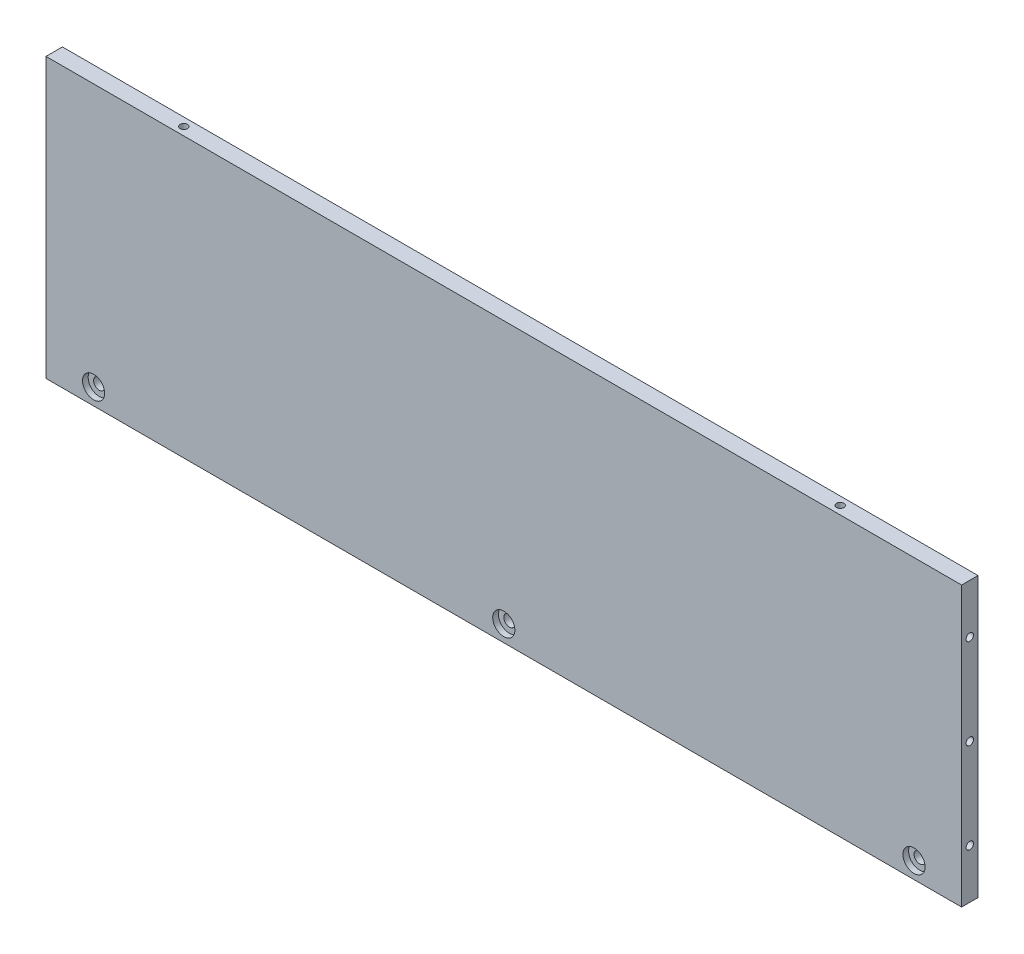
ISO-10303-21;
HEADER;
FILE_DESCRIPTION(('STEP AP214'),'2;1');
FILE_NAME('part.step','',(''),(''),'','','');
FILE_SCHEMA(('AUTOMOTIVE_DESIGN { 1 0 10303 214 1 1 1 1 }'));
ENDSEC;
DATA;
#1=APPLICATION_CONTEXT('core data for automotive mechanical design processes');
#2=APPLICATION_PROTOCOL_DEFINITION('international standard','automotive_design',2000,#1);
#3=PRODUCT_CONTEXT('',#1,'mechanical');
#4=PRODUCT('Part','Part','',(#3));
#5=PRODUCT_RELATED_PRODUCT_CATEGORY('part','',(#4));
#6=PRODUCT_DEFINITION_FORMATION('','',#4);
#7=PRODUCT_DEFINITION_CONTEXT('part definition',#1,'design');
#8=PRODUCT_DEFINITION('design','',#6,#7);
#9=PRODUCT_DEFINITION_SHAPE('','',#8);
#10=(LENGTH_UNIT() NAMED_UNIT(*) SI_UNIT(.MILLI.,.METRE.));
#11=(NAMED_UNIT(*) PLANE_ANGLE_UNIT() SI_UNIT($,.RADIAN.));
#12=(NAMED_UNIT(*) SI_UNIT($,.STERADIAN.) SOLID_ANGLE_UNIT());
#13=UNCERTAINTY_MEASURE_WITH_UNIT(LENGTH_MEASURE(1.E-05),#10,'distance_accuracy_value','');
#14=(GEOMETRIC_REPRESENTATION_CONTEXT(3) GLOBAL_UNCERTAINTY_ASSIGNED_CONTEXT((#13)) GLOBAL_UNIT_ASSIGNED_CONTEXT((#10,
#11,#12)) REPRESENTATION_CONTEXT('',''));
#15=CARTESIAN_POINT('',(0.,0.,0.));
#16=DIRECTION('',(0.,0.,1.));
#17=DIRECTION('',(1.,0.,0.));
#18=AXIS2_PLACEMENT_3D('',#15,#16,#17);
#19=CARTESIAN_POINT('',(-130.996216897856,78.0327868852459,5.));
#20=DIRECTION('',(1.,0.,0.));
#21=DIRECTION('',(0.,1.,0.));
#22=AXIS2_PLACEMENT_3D('',#19,#20,#21);
#23=PLANE('',#22);
#24=CARTESIAN_POINT('',(-130.996216897856,63.0327868852459,2.5));
#25=DIRECTION('',(-1.,0.,0.));
#26=DIRECTION('',(0.,0.,1.));
#27=AXIS2_PLACEMENT_3D('',#24,#25,#26);
#28=CIRCLE('',#27,1.13029999999999);
#29=CARTESIAN_POINT('',(-130.996216897856,63.0327868852459,3.63029999999999));
#30=VERTEX_POINT('',#29);
#31=EDGE_CURVE('E167',#30,#30,#28,.T.);
#32=ORIENTED_EDGE('',*,*,#31,.F.);
#33=EDGE_LOOP('',(#32));
#34=FACE_BOUND('',#33,.T.);
#35=CARTESIAN_POINT('',(-130.996216897856,35.5327868852459,2.5));
#36=DIRECTION('',(-1.,0.,0.));
#37=DIRECTION('',(0.,0.,1.));
#38=AXIS2_PLACEMENT_3D('',#35,#36,#37);
#39=CIRCLE('',#38,1.13029999999999);
#40=CARTESIAN_POINT('',(-130.996216897856,35.5327868852459,3.63029999999999));
#41=VERTEX_POINT('',#40);
#42=EDGE_CURVE('E175',#41,#41,#39,.T.);
#43=ORIENTED_EDGE('',*,*,#42,.F.);
#44=EDGE_LOOP('',(#43));
#45=FACE_BOUND('',#44,.T.);
#46=CARTESIAN_POINT('',(-130.996216897856,8.03278688524591,2.5));
#47=DIRECTION('',(-1.,0.,0.));
#48=DIRECTION('',(0.,0.,1.));
#49=AXIS2_PLACEMENT_3D('',#46,#47,#48);
#50=CIRCLE('',#49,1.13029999999999);
#51=CARTESIAN_POINT('',(-130.996216897856,8.03278688524591,3.63029999999999));
#52=VERTEX_POINT('',#51);
#53=EDGE_CURVE('E183',#52,#52,#50,.T.);
#54=ORIENTED_EDGE('',*,*,#53,.F.);
#55=EDGE_LOOP('',(#54));
#56=FACE_BOUND('',#55,.T.);
#57=DIRECTION('',(0.,-1.,0.));
#58=VECTOR('',#57,1.);
#59=CARTESIAN_POINT('',(-130.996216897856,78.0327868852459,0.));
#60=LINE('',#59,#58);
#61=CARTESIAN_POINT('',(-130.996216897856,78.0327868852459,0.));
#62=VERTEX_POINT('',#61);
#63=CARTESIAN_POINT('',(-130.996216897856,-6.9672131147541,0.));
#64=VERTEX_POINT('',#63);
#65=EDGE_CURVE('E239',#62,#64,#60,.T.);
#66=ORIENTED_EDGE('',*,*,#65,.T.);
#67=DIRECTION('',(0.,0.,-1.));
#68=VECTOR('',#67,1.);
#69=CARTESIAN_POINT('',(-130.996216897856,-6.9672131147541,5.));
#70=LINE('',#69,#68);
#71=CARTESIAN_POINT('',(-130.996216897856,-6.9672131147541,5.));
#72=VERTEX_POINT('',#71);
#73=EDGE_CURVE('E11',#72,#64,#70,.T.);
#74=ORIENTED_EDGE('',*,*,#73,.F.);
#75=DIRECTION('',(0.,-1.,0.));
#76=VECTOR('',#75,1.);
#77=CARTESIAN_POINT('',(-130.996216897856,78.0327868852459,5.));
#78=LINE('',#77,#76);
#79=CARTESIAN_POINT('',(-130.996216897856,78.0327868852459,5.));
#80=VERTEX_POINT('',#79);
#81=EDGE_CURVE('E240',#80,#72,#78,.T.);
#82=ORIENTED_EDGE('',*,*,#81,.F.);
#83=DIRECTION('',(0.,0.,-1.));
#84=VECTOR('',#83,1.);
#85=CARTESIAN_POINT('',(-130.996216897856,78.0327868852459,5.));
#86=LINE('',#85,#84);
#87=EDGE_CURVE('E250',#80,#62,#86,.T.);
#88=ORIENTED_EDGE('',*,*,#87,.T.);
#89=EDGE_LOOP('',(#66,#74,#82,#88));
#90=FACE_BOUND('',#89,.T.);
#91=ADVANCED_FACE('F45',(#34,#45,#56,#90),#23,.F.);
#92=CARTESIAN_POINT('',(-130.996216897856,-6.9672131147541,5.));
#93=DIRECTION('',(0.,1.,0.));
#94=DIRECTION('',(0.,0.,1.));
#95=AXIS2_PLACEMENT_3D('',#92,#93,#94);
#96=PLANE('',#95);
#97=DIRECTION('',(1.,0.,0.));
#98=VECTOR('',#97,1.);
#99=CARTESIAN_POINT('',(-130.996216897856,-6.9672131147541,0.));
#100=LINE('',#99,#98);
#101=CARTESIAN_POINT('',(148.003783102144,-6.9672131147541,0.));
#102=VERTEX_POINT('',#101);
#103=EDGE_CURVE('E254',#64,#102,#100,.T.);
#104=ORIENTED_EDGE('',*,*,#103,.T.);
#105=DIRECTION('',(0.,0.,-1.));
#106=VECTOR('',#105,1.);
#107=CARTESIAN_POINT('',(148.003783102144,-6.9672131147541,5.));
#108=LINE('',#107,#106);
#109=CARTESIAN_POINT('',(148.003783102144,-6.9672131147541,5.));
#110=VERTEX_POINT('',#109);
#111=EDGE_CURVE('E54',#110,#102,#108,.T.);
#112=ORIENTED_EDGE('',*,*,#111,.F.);
#113=DIRECTION('',(1.,0.,0.));
#114=VECTOR('',#113,1.);
#115=CARTESIAN_POINT('',(-130.996216897856,-6.9672131147541,5.));
#116=LINE('',#115,#114);
#117=EDGE_CURVE('E93',#72,#110,#116,.T.);
#118=ORIENTED_EDGE('',*,*,#117,.F.);
#119=ORIENTED_EDGE('',*,*,#73,.T.);
#120=EDGE_LOOP('',(#104,#112,#118,#119));
#121=FACE_BOUND('',#120,.T.);
#122=ADVANCED_FACE('F285',(#121),#96,.F.);
#123=CARTESIAN_POINT('',(148.003783102144,78.0327868852459,5.));
#124=DIRECTION('',(-1.,0.,0.));
#125=DIRECTION('',(0.,-1.,0.));
#126=AXIS2_PLACEMENT_3D('',#123,#124,#125);
#127=PLANE('',#126);
#128=CARTESIAN_POINT('',(148.003783102144,63.0327868852458,2.5));
#129=DIRECTION('',(1.,0.,0.));
#130=DIRECTION('',(0.,0.,-1.));
#131=AXIS2_PLACEMENT_3D('',#128,#129,#130);
#132=CIRCLE('',#131,1.13029999999999);
#133=CARTESIAN_POINT('',(148.003783102144,63.0327868852458,1.36970000000001));
#134=VERTEX_POINT('',#133);
#135=EDGE_CURVE('E143',#134,#134,#132,.T.);
#136=ORIENTED_EDGE('',*,*,#135,.F.);
#137=EDGE_LOOP('',(#136));
#138=FACE_BOUND('',#137,.T.);
#139=CARTESIAN_POINT('',(148.003783102144,35.5327868852458,2.5));
#140=DIRECTION('',(1.,0.,0.));
#141=DIRECTION('',(0.,0.,-1.));
#142=AXIS2_PLACEMENT_3D('',#139,#140,#141);
#143=CIRCLE('',#142,1.13029999999999);
#144=CARTESIAN_POINT('',(148.003783102144,35.5327868852458,1.36970000000001));
#145=VERTEX_POINT('',#144);
#146=EDGE_CURVE('E151',#145,#145,#143,.T.);
#147=ORIENTED_EDGE('',*,*,#146,.F.);
#148=EDGE_LOOP('',(#147));
#149=FACE_BOUND('',#148,.T.);
#150=CARTESIAN_POINT('',(148.003783102144,8.03278688524579,2.5));
#151=DIRECTION('',(1.,0.,0.));
#152=DIRECTION('',(0.,0.,-1.));
#153=AXIS2_PLACEMENT_3D('',#150,#151,#152);
#154=CIRCLE('',#153,1.13029999999999);
#155=CARTESIAN_POINT('',(148.003783102144,8.03278688524579,1.36970000000001));
#156=VERTEX_POINT('',#155);
#157=EDGE_CURVE('E159',#156,#156,#154,.T.);
#158=ORIENTED_EDGE('',*,*,#157,.F.);
#159=EDGE_LOOP('',(#158));
#160=FACE_BOUND('',#159,.T.);
#161=DIRECTION('',(0.,1.,0.));
#162=VECTOR('',#161,1.);
#163=CARTESIAN_POINT('',(148.003783102144,78.0327868852459,0.));
#164=LINE('',#163,#162);
#165=CARTESIAN_POINT('',(148.003783102144,78.0327868852459,0.));
#166=VERTEX_POINT('',#165);
#167=EDGE_CURVE('E80',#102,#166,#164,.T.);
#168=ORIENTED_EDGE('',*,*,#167,.T.);
#169=DIRECTION('',(0.,0.,-1.));
#170=VECTOR('',#169,1.);
#171=CARTESIAN_POINT('',(148.003783102144,78.0327868852459,5.));
#172=LINE('',#171,#170);
#173=CARTESIAN_POINT('',(148.003783102144,78.0327868852459,5.));
#174=VERTEX_POINT('',#173);
#175=EDGE_CURVE('E263',#174,#166,#172,.T.);
#176=ORIENTED_EDGE('',*,*,#175,.F.);
#177=DIRECTION('',(0.,1.,0.));
#178=VECTOR('',#177,1.);
#179=CARTESIAN_POINT('',(148.003783102144,78.0327868852459,5.));
#180=LINE('',#179,#178);
#181=EDGE_CURVE('E245',#110,#174,#180,.T.);
#182=ORIENTED_EDGE('',*,*,#181,.F.);
#183=ORIENTED_EDGE('',*,*,#111,.T.);
#184=EDGE_LOOP('',(#168,#176,#182,#183));
#185=FACE_BOUND('',#184,.T.);
#186=ADVANCED_FACE('F267',(#138,#149,#160,#185),#127,.F.);
#187=CARTESIAN_POINT('',(-130.996216897856,78.0327868852459,5.));
#188=DIRECTION('',(0.,-1.,0.));
#189=DIRECTION('',(0.,0.,-1.));
#190=AXIS2_PLACEMENT_3D('',#187,#188,#189);
#191=PLANE('',#190);
#192=CARTESIAN_POINT('',(-91.4962168978563,78.0327868852459,2.5));
#193=DIRECTION('',(0.,1.,0.));
#194=DIRECTION('',(0.,0.,1.));
#195=AXIS2_PLACEMENT_3D('',#192,#193,#194);
#196=CIRCLE('',#195,1.13029999999999);
#197=CARTESIAN_POINT('',(-91.4962168978563,78.0327868852459,3.63029999999999));
#198=VERTEX_POINT('',#197);
#199=EDGE_CURVE('E130',#198,#198,#196,.T.);
#200=ORIENTED_EDGE('',*,*,#199,.F.);
#201=EDGE_LOOP('',(#200));
#202=FACE_BOUND('',#201,.T.);
#203=CARTESIAN_POINT('',(108.503783102144,78.0327868852459,2.5));
#204=DIRECTION('',(0.,1.,0.));
#205=DIRECTION('',(0.,0.,1.));
#206=AXIS2_PLACEMENT_3D('',#203,#204,#205);
#207=CIRCLE('',#206,1.13029999999999);
#208=CARTESIAN_POINT('',(108.503783102144,78.0327868852459,3.63029999999999));
#209=VERTEX_POINT('',#208);
#210=EDGE_CURVE('E129',#209,#209,#207,.T.);
#211=ORIENTED_EDGE('',*,*,#210,.F.);
#212=EDGE_LOOP('',(#211));
#213=FACE_BOUND('',#212,.T.);
#214=DIRECTION('',(-1.,0.,0.));
#215=VECTOR('',#214,1.);
#216=CARTESIAN_POINT('',(-130.996216897856,78.0327868852459,0.));
#217=LINE('',#216,#215);
#218=EDGE_CURVE('E86',#166,#62,#217,.T.);
#219=ORIENTED_EDGE('',*,*,#218,.T.);
#220=ORIENTED_EDGE('',*,*,#87,.F.);
#221=DIRECTION('',(-1.,0.,0.));
#222=VECTOR('',#221,1.);
#223=CARTESIAN_POINT('',(-130.996216897856,78.0327868852459,5.));
#224=LINE('',#223,#222);
#225=EDGE_CURVE('E62',#174,#80,#224,.T.);
#226=ORIENTED_EDGE('',*,*,#225,.F.);
#227=ORIENTED_EDGE('',*,*,#175,.T.);
#228=EDGE_LOOP('',(#219,#220,#226,#227));
#229=FACE_BOUND('',#228,.T.);
#230=ADVANCED_FACE('F274',(#202,#213,#229),#191,.F.);
#231=CARTESIAN_POINT('',(0.,0.,5.));
#232=DIRECTION('',(0.,0.,1.));
#233=DIRECTION('',(1.,0.,0.));
#234=AXIS2_PLACEMENT_3D('',#231,#232,#233);
#235=PLANE('',#234);
#236=CARTESIAN_POINT('',(-116.496216897856,-1.96721311475409,5.));
#237=DIRECTION('',(0.,0.,1.));
#238=DIRECTION('',(1.,0.,0.));
#239=AXIS2_PLACEMENT_3D('',#236,#237,#238);
#240=CIRCLE('',#239,3.37311999999999);
#241=CARTESIAN_POINT('',(-113.123096897856,-1.96721311475409,5.));
#242=VERTEX_POINT('',#241);
#243=EDGE_CURVE('E191',#242,#242,#240,.T.);
#244=ORIENTED_EDGE('',*,*,#243,.F.);
#245=EDGE_LOOP('',(#244));
#246=FACE_BOUND('',#245,.T.);
#247=CARTESIAN_POINT('',(8.50378310214372,-1.96721311475409,5.));
#248=DIRECTION('',(0.,0.,1.));
#249=DIRECTION('',(1.,0.,0.));
#250=AXIS2_PLACEMENT_3D('',#247,#248,#249);
#251=CIRCLE('',#250,3.37311999999999);
#252=CARTESIAN_POINT('',(11.8769031021437,-1.96721311475409,5.));
#253=VERTEX_POINT('',#252);
#254=EDGE_CURVE('E207',#253,#253,#251,.T.);
#255=ORIENTED_EDGE('',*,*,#254,.F.);
#256=EDGE_LOOP('',(#255));
#257=FACE_BOUND('',#256,.T.);
#258=CARTESIAN_POINT('',(133.503783102144,-1.96721311475409,5.));
#259=DIRECTION('',(0.,0.,1.));
#260=DIRECTION('',(1.,0.,0.));
#261=AXIS2_PLACEMENT_3D('',#258,#259,#260);
#262=CIRCLE('',#261,3.37312000000001);
#263=CARTESIAN_POINT('',(136.876903102144,-1.96721311475409,5.));
#264=VERTEX_POINT('',#263);
#265=EDGE_CURVE('E223',#264,#264,#262,.T.);
#266=ORIENTED_EDGE('',*,*,#265,.F.);
#267=EDGE_LOOP('',(#266));
#268=FACE_BOUND('',#267,.T.);
#269=ORIENTED_EDGE('',*,*,#81,.T.);
#270=ORIENTED_EDGE('',*,*,#117,.T.);
#271=ORIENTED_EDGE('',*,*,#181,.T.);
#272=ORIENTED_EDGE('',*,*,#225,.T.);
#273=EDGE_LOOP('',(#269,#270,#271,#272));
#274=FACE_BOUND('',#273,.T.);
#275=ADVANCED_FACE('F276',(#246,#257,#268,#274),#235,.T.);
#276=CARTESIAN_POINT('',(0.,0.,0.));
#277=DIRECTION('',(0.,0.,1.));
#278=DIRECTION('',(1.,0.,0.));
#279=AXIS2_PLACEMENT_3D('',#276,#277,#278);
#280=PLANE('',#279);
#281=CARTESIAN_POINT('',(-116.496216897856,-1.96721311475409,0.));
#282=DIRECTION('',(0.,0.,1.));
#283=DIRECTION('',(1.,0.,0.));
#284=AXIS2_PLACEMENT_3D('',#281,#282,#283);
#285=CIRCLE('',#284,1.7272);
#286=CARTESIAN_POINT('',(-114.769016897856,-1.96721311475409,0.));
#287=VERTEX_POINT('',#286);
#288=EDGE_CURVE('E203',#287,#287,#285,.T.);
#289=ORIENTED_EDGE('',*,*,#288,.T.);
#290=EDGE_LOOP('',(#289));
#291=FACE_BOUND('',#290,.T.);
#292=CARTESIAN_POINT('',(8.50378310214372,-1.96721311475409,0.));
#293=DIRECTION('',(0.,0.,1.));
#294=DIRECTION('',(1.,0.,0.));
#295=AXIS2_PLACEMENT_3D('',#292,#293,#294);
#296=CIRCLE('',#295,1.7272);
#297=CARTESIAN_POINT('',(10.2309831021437,-1.96721311475409,0.));
#298=VERTEX_POINT('',#297);
#299=EDGE_CURVE('E219',#298,#298,#296,.T.);
#300=ORIENTED_EDGE('',*,*,#299,.T.);
#301=EDGE_LOOP('',(#300));
#302=FACE_BOUND('',#301,.T.);
#303=CARTESIAN_POINT('',(133.503783102144,-1.96721311475409,0.));
#304=DIRECTION('',(0.,0.,1.));
#305=DIRECTION('',(1.,0.,0.));
#306=AXIS2_PLACEMENT_3D('',#303,#304,#305);
#307=CIRCLE('',#306,1.72720000000001);
#308=CARTESIAN_POINT('',(135.230983102144,-1.96721311475409,0.));
#309=VERTEX_POINT('',#308);
#310=EDGE_CURVE('E235',#309,#309,#307,.T.);
#311=ORIENTED_EDGE('',*,*,#310,.T.);
#312=EDGE_LOOP('',(#311));
#313=FACE_BOUND('',#312,.T.);
#314=ORIENTED_EDGE('',*,*,#65,.F.);
#315=ORIENTED_EDGE('',*,*,#218,.F.);
#316=ORIENTED_EDGE('',*,*,#167,.F.);
#317=ORIENTED_EDGE('',*,*,#103,.F.);
#318=EDGE_LOOP('',(#314,#315,#316,#317));
#319=FACE_BOUND('',#318,.T.);
#320=ADVANCED_FACE('F270',(#291,#302,#313,#319),#280,.F.);
#321=CARTESIAN_POINT('',(133.503783102144,-1.96721311475409,5.));
#322=DIRECTION('',(0.,0.,1.));
#323=DIRECTION('',(1.,0.,0.));
#324=AXIS2_PLACEMENT_3D('',#321,#322,#323);
#325=CYLINDRICAL_SURFACE('',#324,1.72720000000001);
#326=ORIENTED_EDGE('',*,*,#310,.F.);
#327=EDGE_LOOP('',(#326));
#328=FACE_BOUND('',#327,.T.);
#329=CARTESIAN_POINT('',(133.503783102144,-1.96721311475409,3.2728));
#330=DIRECTION('',(0.,0.,1.));
#331=DIRECTION('',(1.,0.,0.));
#332=AXIS2_PLACEMENT_3D('',#329,#330,#331);
#333=CIRCLE('',#332,1.72720000000001);
#334=CARTESIAN_POINT('',(135.230983102144,-1.96721311475409,3.2728));
#335=VERTEX_POINT('',#334);
#336=EDGE_CURVE('E231',#335,#335,#333,.T.);
#337=ORIENTED_EDGE('',*,*,#336,.T.);
#338=EDGE_LOOP('',(#337));
#339=FACE_BOUND('',#338,.T.);
#340=ADVANCED_FACE('F351',(#328,#339),#325,.F.);
#341=CARTESIAN_POINT('',(135.230983102144,-1.96721311475409,3.2728));
#342=DIRECTION('',(0.,0.,-1.));
#343=DIRECTION('',(-1.,0.,0.));
#344=AXIS2_PLACEMENT_3D('',#341,#342,#343);
#345=PLANE('',#344);
#346=ORIENTED_EDGE('',*,*,#336,.F.);
#347=EDGE_LOOP('',(#346));
#348=FACE_BOUND('',#347,.T.);
#349=CARTESIAN_POINT('',(133.503783102144,-1.96721311475409,3.2728));
#350=DIRECTION('',(0.,0.,1.));
#351=DIRECTION('',(1.,0.,0.));
#352=AXIS2_PLACEMENT_3D('',#349,#350,#351);
#353=CIRCLE('',#352,3.37312000000001);
#354=CARTESIAN_POINT('',(136.876903102144,-1.96721311475409,3.2728));
#355=VERTEX_POINT('',#354);
#356=EDGE_CURVE('E227',#355,#355,#353,.T.);
#357=ORIENTED_EDGE('',*,*,#356,.T.);
#358=EDGE_LOOP('',(#357));
#359=FACE_BOUND('',#358,.T.);
#360=ADVANCED_FACE('F347',(#348,#359),#345,.F.);
#361=CARTESIAN_POINT('',(133.503783102144,-1.96721311475409,5.));
#362=DIRECTION('',(0.,0.,1.));
#363=DIRECTION('',(1.,0.,0.));
#364=AXIS2_PLACEMENT_3D('',#361,#362,#363);
#365=CYLINDRICAL_SURFACE('',#364,3.37312000000001);
#366=ORIENTED_EDGE('',*,*,#356,.F.);
#367=EDGE_LOOP('',(#366));
#368=FACE_BOUND('',#367,.T.);
#369=ORIENTED_EDGE('',*,*,#265,.T.);
#370=EDGE_LOOP('',(#369));
#371=FACE_BOUND('',#370,.T.);
#372=ADVANCED_FACE('F343',(#368,#371),#365,.F.);
#373=CARTESIAN_POINT('',(8.50378310214372,-1.96721311475409,5.));
#374=DIRECTION('',(0.,0.,1.));
#375=DIRECTION('',(1.,0.,0.));
#376=AXIS2_PLACEMENT_3D('',#373,#374,#375);
#377=CYLINDRICAL_SURFACE('',#376,1.72720000000001);
#378=ORIENTED_EDGE('',*,*,#299,.F.);
#379=EDGE_LOOP('',(#378));
#380=FACE_BOUND('',#379,.T.);
#381=CARTESIAN_POINT('',(8.50378310214372,-1.96721311475409,3.2728));
#382=DIRECTION('',(0.,0.,1.));
#383=DIRECTION('',(1.,0.,0.));
#384=AXIS2_PLACEMENT_3D('',#381,#382,#383);
#385=CIRCLE('',#384,1.72720000000001);
#386=CARTESIAN_POINT('',(10.2309831021437,-1.96721311475409,3.2728));
#387=VERTEX_POINT('',#386);
#388=EDGE_CURVE('E215',#387,#387,#385,.T.);
#389=ORIENTED_EDGE('',*,*,#388,.T.);
#390=EDGE_LOOP('',(#389));
#391=FACE_BOUND('',#390,.T.);
#392=ADVANCED_FACE('F339',(#380,#391),#377,.F.);
#393=CARTESIAN_POINT('',(10.2309831021437,-1.96721311475409,3.2728));
#394=DIRECTION('',(0.,0.,-1.));
#395=DIRECTION('',(-1.,0.,0.));
#396=AXIS2_PLACEMENT_3D('',#393,#394,#395);
#397=PLANE('',#396);
#398=ORIENTED_EDGE('',*,*,#388,.F.);
#399=EDGE_LOOP('',(#398));
#400=FACE_BOUND('',#399,.T.);
#401=CARTESIAN_POINT('',(8.50378310214372,-1.96721311475409,3.2728));
#402=DIRECTION('',(0.,0.,1.));
#403=DIRECTION('',(1.,0.,0.));
#404=AXIS2_PLACEMENT_3D('',#401,#402,#403);
#405=CIRCLE('',#404,3.37311999999999);
#406=CARTESIAN_POINT('',(11.8769031021437,-1.96721311475409,3.2728));
#407=VERTEX_POINT('',#406);
#408=EDGE_CURVE('E211',#407,#407,#405,.T.);
#409=ORIENTED_EDGE('',*,*,#408,.T.);
#410=EDGE_LOOP('',(#409));
#411=FACE_BOUND('',#410,.T.);
#412=ADVANCED_FACE('F335',(#400,#411),#397,.F.);
#413=CARTESIAN_POINT('',(8.50378310214372,-1.96721311475409,5.));
#414=DIRECTION('',(0.,0.,1.));
#415=DIRECTION('',(1.,0.,0.));
#416=AXIS2_PLACEMENT_3D('',#413,#414,#415);
#417=CYLINDRICAL_SURFACE('',#416,3.37311999999999);
#418=ORIENTED_EDGE('',*,*,#408,.F.);
#419=EDGE_LOOP('',(#418));
#420=FACE_BOUND('',#419,.T.);
#421=ORIENTED_EDGE('',*,*,#254,.T.);
#422=EDGE_LOOP('',(#421));
#423=FACE_BOUND('',#422,.T.);
#424=ADVANCED_FACE('F331',(#420,#423),#417,.F.);
#425=CARTESIAN_POINT('',(-116.496216897856,-1.96721311475409,5.));
#426=DIRECTION('',(0.,0.,1.));
#427=DIRECTION('',(1.,0.,0.));
#428=AXIS2_PLACEMENT_3D('',#425,#426,#427);
#429=CYLINDRICAL_SURFACE('',#428,1.72720000000001);
#430=ORIENTED_EDGE('',*,*,#288,.F.);
#431=EDGE_LOOP('',(#430));
#432=FACE_BOUND('',#431,.T.);
#433=CARTESIAN_POINT('',(-116.496216897856,-1.96721311475409,3.2728));
#434=DIRECTION('',(0.,0.,1.));
#435=DIRECTION('',(1.,0.,0.));
#436=AXIS2_PLACEMENT_3D('',#433,#434,#435);
#437=CIRCLE('',#436,1.72720000000001);
#438=CARTESIAN_POINT('',(-114.769016897856,-1.96721311475409,3.2728));
#439=VERTEX_POINT('',#438);
#440=EDGE_CURVE('E199',#439,#439,#437,.T.);
#441=ORIENTED_EDGE('',*,*,#440,.T.);
#442=EDGE_LOOP('',(#441));
#443=FACE_BOUND('',#442,.T.);
#444=ADVANCED_FACE('F327',(#432,#443),#429,.F.);
#445=CARTESIAN_POINT('',(-114.769016897856,-1.96721311475409,3.2728));
#446=DIRECTION('',(0.,0.,-1.));
#447=DIRECTION('',(-1.,0.,0.));
#448=AXIS2_PLACEMENT_3D('',#445,#446,#447);
#449=PLANE('',#448);
#450=ORIENTED_EDGE('',*,*,#440,.F.);
#451=EDGE_LOOP('',(#450));
#452=FACE_BOUND('',#451,.T.);
#453=CARTESIAN_POINT('',(-116.496216897856,-1.96721311475409,3.2728));
#454=DIRECTION('',(0.,0.,1.));
#455=DIRECTION('',(1.,0.,0.));
#456=AXIS2_PLACEMENT_3D('',#453,#454,#455);
#457=CIRCLE('',#456,3.37311999999999);
#458=CARTESIAN_POINT('',(-113.123096897856,-1.96721311475409,3.2728));
#459=VERTEX_POINT('',#458);
#460=EDGE_CURVE('E195',#459,#459,#457,.T.);
#461=ORIENTED_EDGE('',*,*,#460,.T.);
#462=EDGE_LOOP('',(#461));
#463=FACE_BOUND('',#462,.T.);
#464=ADVANCED_FACE('F323',(#452,#463),#449,.F.);
#465=CARTESIAN_POINT('',(-116.496216897856,-1.96721311475409,5.));
#466=DIRECTION('',(0.,0.,1.));
#467=DIRECTION('',(1.,0.,0.));
#468=AXIS2_PLACEMENT_3D('',#465,#466,#467);
#469=CYLINDRICAL_SURFACE('',#468,3.37311999999999);
#470=ORIENTED_EDGE('',*,*,#460,.F.);
#471=EDGE_LOOP('',(#470));
#472=FACE_BOUND('',#471,.T.);
#473=ORIENTED_EDGE('',*,*,#243,.T.);
#474=EDGE_LOOP('',(#473));
#475=FACE_BOUND('',#474,.T.);
#476=ADVANCED_FACE('F315',(#472,#475),#469,.F.);
#477=CARTESIAN_POINT('',(-123.396216897856,8.03278688524591,2.5));
#478=DIRECTION('',(-1.,0.,0.));
#479=DIRECTION('',(0.,0.,1.));
#480=AXIS2_PLACEMENT_3D('',#477,#478,#479);
#481=CONICAL_SURFACE('',#480,1.13029999999999,1.02974425867665);
#482=CARTESIAN_POINT('',(-122.717064140169,8.0327868852459,2.5));
#483=VERTEX_POINT('',#482);
#484=VERTEX_LOOP('',#483);
#485=FACE_BOUND('',#484,.T.);
#486=CARTESIAN_POINT('',(-123.396216897856,8.03278688524591,2.5));
#487=DIRECTION('',(-1.,0.,0.));
#488=DIRECTION('',(0.,0.,1.));
#489=AXIS2_PLACEMENT_3D('',#486,#487,#488);
#490=CIRCLE('',#489,1.13029999999999);
#491=CARTESIAN_POINT('',(-123.396216897856,8.03278688524591,3.63029999999999));
#492=VERTEX_POINT('',#491);
#493=EDGE_CURVE('E187',#492,#492,#490,.T.);
#494=ORIENTED_EDGE('',*,*,#493,.T.);
#495=EDGE_LOOP('',(#494));
#496=FACE_BOUND('',#495,.T.);
#497=ADVANCED_FACE('F305',(#485,#496),#481,.F.);
#498=CARTESIAN_POINT('',(-130.996216897856,8.03278688524591,2.5));
#499=DIRECTION('',(-1.,0.,0.));
#500=DIRECTION('',(0.,0.,1.));
#501=AXIS2_PLACEMENT_3D('',#498,#499,#500);
#502=CYLINDRICAL_SURFACE('',#501,1.13029999999999);
#503=ORIENTED_EDGE('',*,*,#493,.F.);
#504=EDGE_LOOP('',(#503));
#505=FACE_BOUND('',#504,.T.);
#506=ORIENTED_EDGE('',*,*,#53,.T.);
#507=EDGE_LOOP('',(#506));
#508=FACE_BOUND('',#507,.T.);
#509=ADVANCED_FACE('F302',(#505,#508),#502,.F.);
#510=CARTESIAN_POINT('',(-123.396216897856,35.5327868852459,2.5));
#511=DIRECTION('',(-1.,0.,0.));
#512=DIRECTION('',(0.,0.,1.));
#513=AXIS2_PLACEMENT_3D('',#510,#511,#512);
#514=CONICAL_SURFACE('',#513,1.13029999999999,1.02974425867665);
#515=CARTESIAN_POINT('',(-122.717064140169,35.5327868852459,2.5));
#516=VERTEX_POINT('',#515);
#517=VERTEX_LOOP('',#516);
#518=FACE_BOUND('',#517,.T.);
#519=CARTESIAN_POINT('',(-123.396216897856,35.5327868852459,2.5));
#520=DIRECTION('',(-1.,0.,0.));
#521=DIRECTION('',(0.,0.,1.));
#522=AXIS2_PLACEMENT_3D('',#519,#520,#521);
#523=CIRCLE('',#522,1.13029999999999);
#524=CARTESIAN_POINT('',(-123.396216897856,35.5327868852459,3.63029999999999));
#525=VERTEX_POINT('',#524);
#526=EDGE_CURVE('E179',#525,#525,#523,.T.);
#527=ORIENTED_EDGE('',*,*,#526,.T.);
#528=EDGE_LOOP('',(#527));
#529=FACE_BOUND('',#528,.T.);
#530=ADVANCED_FACE('F304',(#518,#529),#514,.F.);
#531=CARTESIAN_POINT('',(-130.996216897856,35.5327868852459,2.5));
#532=DIRECTION('',(-1.,0.,0.));
#533=DIRECTION('',(0.,0.,1.));
#534=AXIS2_PLACEMENT_3D('',#531,#532,#533);
#535=CYLINDRICAL_SURFACE('',#534,1.13029999999999);
#536=ORIENTED_EDGE('',*,*,#526,.F.);
#537=EDGE_LOOP('',(#536));
#538=FACE_BOUND('',#537,.T.);
#539=ORIENTED_EDGE('',*,*,#42,.T.);
#540=EDGE_LOOP('',(#539));
#541=FACE_BOUND('',#540,.T.);
#542=ADVANCED_FACE('F312',(#538,#541),#535,.F.);
#543=CARTESIAN_POINT('',(-123.396216897856,63.0327868852459,2.5));
#544=DIRECTION('',(-1.,0.,0.));
#545=DIRECTION('',(0.,0.,1.));
#546=AXIS2_PLACEMENT_3D('',#543,#544,#545);
#547=CONICAL_SURFACE('',#546,1.13029999999999,1.02974425867665);
#548=CARTESIAN_POINT('',(-122.717064140169,63.0327868852459,2.5));
#549=VERTEX_POINT('',#548);
#550=VERTEX_LOOP('',#549);
#551=FACE_BOUND('',#550,.T.);
#552=CARTESIAN_POINT('',(-123.396216897856,63.0327868852459,2.5));
#553=DIRECTION('',(-1.,0.,0.));
#554=DIRECTION('',(0.,0.,1.));
#555=AXIS2_PLACEMENT_3D('',#552,#553,#554);
#556=CIRCLE('',#555,1.13029999999999);
#557=CARTESIAN_POINT('',(-123.396216897856,63.0327868852459,3.63029999999999));
#558=VERTEX_POINT('',#557);
#559=EDGE_CURVE('E171',#558,#558,#556,.T.);
#560=ORIENTED_EDGE('',*,*,#559,.T.);
#561=EDGE_LOOP('',(#560));
#562=FACE_BOUND('',#561,.T.);
#563=ADVANCED_FACE('F454',(#551,#562),#547,.F.);
#564=CARTESIAN_POINT('',(-130.996216897856,63.0327868852459,2.5));
#565=DIRECTION('',(-1.,0.,0.));
#566=DIRECTION('',(0.,0.,1.));
#567=AXIS2_PLACEMENT_3D('',#564,#565,#566);
#568=CYLINDRICAL_SURFACE('',#567,1.13029999999999);
#569=ORIENTED_EDGE('',*,*,#559,.F.);
#570=EDGE_LOOP('',(#569));
#571=FACE_BOUND('',#570,.T.);
#572=ORIENTED_EDGE('',*,*,#31,.T.);
#573=EDGE_LOOP('',(#572));
#574=FACE_BOUND('',#573,.T.);
#575=ADVANCED_FACE('F465',(#571,#574),#568,.F.);
#576=CARTESIAN_POINT('',(140.403783102144,8.03278688524579,2.5));
#577=DIRECTION('',(1.,0.,0.));
#578=DIRECTION('',(0.,0.,-1.));
#579=AXIS2_PLACEMENT_3D('',#576,#577,#578);
#580=CONICAL_SURFACE('',#579,1.13029999999999,1.02974425867665);
#581=CARTESIAN_POINT('',(139.724630344457,8.03278688524579,2.5));
#582=VERTEX_POINT('',#581);
#583=VERTEX_LOOP('',#582);
#584=FACE_BOUND('',#583,.T.);
#585=CARTESIAN_POINT('',(140.403783102144,8.03278688524579,2.5));
#586=DIRECTION('',(1.,0.,0.));
#587=DIRECTION('',(0.,0.,-1.));
#588=AXIS2_PLACEMENT_3D('',#585,#586,#587);
#589=CIRCLE('',#588,1.13029999999999);
#590=CARTESIAN_POINT('',(140.403783102144,8.03278688524579,1.36970000000001));
#591=VERTEX_POINT('',#590);
#592=EDGE_CURVE('E163',#591,#591,#589,.T.);
#593=ORIENTED_EDGE('',*,*,#592,.T.);
#594=EDGE_LOOP('',(#593));
#595=FACE_BOUND('',#594,.T.);
#596=ADVANCED_FACE('F475',(#584,#595),#580,.F.);
#597=CARTESIAN_POINT('',(148.003783102144,8.03278688524579,2.5));
#598=DIRECTION('',(1.,0.,0.));
#599=DIRECTION('',(0.,0.,-1.));
#600=AXIS2_PLACEMENT_3D('',#597,#598,#599);
#601=CYLINDRICAL_SURFACE('',#600,1.13029999999999);
#602=ORIENTED_EDGE('',*,*,#592,.F.);
#603=EDGE_LOOP('',(#602));
#604=FACE_BOUND('',#603,.T.);
#605=ORIENTED_EDGE('',*,*,#157,.T.);
#606=EDGE_LOOP('',(#605));
#607=FACE_BOUND('',#606,.T.);
#608=ADVANCED_FACE('F498',(#604,#607),#601,.F.);
#609=CARTESIAN_POINT('',(140.403783102144,35.5327868852458,2.5));
#610=DIRECTION('',(1.,0.,0.));
#611=DIRECTION('',(0.,0.,-1.));
#612=AXIS2_PLACEMENT_3D('',#609,#610,#611);
#613=CONICAL_SURFACE('',#612,1.13029999999999,1.02974425867665);
#614=CARTESIAN_POINT('',(139.724630344457,35.5327868852458,2.5));
#615=VERTEX_POINT('',#614);
#616=VERTEX_LOOP('',#615);
#617=FACE_BOUND('',#616,.T.);
#618=CARTESIAN_POINT('',(140.403783102144,35.5327868852458,2.5));
#619=DIRECTION('',(1.,0.,0.));
#620=DIRECTION('',(0.,0.,-1.));
#621=AXIS2_PLACEMENT_3D('',#618,#619,#620);
#622=CIRCLE('',#621,1.13029999999999);
#623=CARTESIAN_POINT('',(140.403783102144,35.5327868852458,1.36970000000001));
#624=VERTEX_POINT('',#623);
#625=EDGE_CURVE('E155',#624,#624,#622,.T.);
#626=ORIENTED_EDGE('',*,*,#625,.T.);
#627=EDGE_LOOP('',(#626));
#628=FACE_BOUND('',#627,.T.);
#629=ADVANCED_FACE('F508',(#617,#628),#613,.F.);
#630=CARTESIAN_POINT('',(148.003783102144,35.5327868852458,2.5));
#631=DIRECTION('',(1.,0.,0.));
#632=DIRECTION('',(0.,0.,-1.));
#633=AXIS2_PLACEMENT_3D('',#630,#631,#632);
#634=CYLINDRICAL_SURFACE('',#633,1.13029999999999);
#635=ORIENTED_EDGE('',*,*,#625,.F.);
#636=EDGE_LOOP('',(#635));
#637=FACE_BOUND('',#636,.T.);
#638=ORIENTED_EDGE('',*,*,#146,.T.);
#639=EDGE_LOOP('',(#638));
#640=FACE_BOUND('',#639,.T.);
#641=ADVANCED_FACE('F520',(#637,#640),#634,.F.);
#642=CARTESIAN_POINT('',(140.403783102144,63.0327868852458,2.5));
#643=DIRECTION('',(1.,0.,0.));
#644=DIRECTION('',(0.,0.,-1.));
#645=AXIS2_PLACEMENT_3D('',#642,#643,#644);
#646=CONICAL_SURFACE('',#645,1.13029999999999,1.02974425867665);
#647=CARTESIAN_POINT('',(139.724630344457,63.0327868852458,2.5));
#648=VERTEX_POINT('',#647);
#649=VERTEX_LOOP('',#648);
#650=FACE_BOUND('',#649,.T.);
#651=CARTESIAN_POINT('',(140.403783102144,63.0327868852458,2.5));
#652=DIRECTION('',(1.,0.,0.));
#653=DIRECTION('',(0.,0.,-1.));
#654=AXIS2_PLACEMENT_3D('',#651,#652,#653);
#655=CIRCLE('',#654,1.13029999999999);
#656=CARTESIAN_POINT('',(140.403783102144,63.0327868852458,1.36970000000001));
#657=VERTEX_POINT('',#656);
#658=EDGE_CURVE('E147',#657,#657,#655,.T.);
#659=ORIENTED_EDGE('',*,*,#658,.T.);
#660=EDGE_LOOP('',(#659));
#661=FACE_BOUND('',#660,.T.);
#662=ADVANCED_FACE('F530',(#650,#661),#646,.F.);
#663=CARTESIAN_POINT('',(148.003783102144,63.0327868852458,2.5));
#664=DIRECTION('',(1.,0.,0.));
#665=DIRECTION('',(0.,0.,-1.));
#666=AXIS2_PLACEMENT_3D('',#663,#664,#665);
#667=CYLINDRICAL_SURFACE('',#666,1.13029999999999);
#668=ORIENTED_EDGE('',*,*,#658,.F.);
#669=EDGE_LOOP('',(#668));
#670=FACE_BOUND('',#669,.T.);
#671=ORIENTED_EDGE('',*,*,#135,.T.);
#672=EDGE_LOOP('',(#671));
#673=FACE_BOUND('',#672,.T.);
#674=ADVANCED_FACE('F542',(#670,#673),#667,.F.);
#675=CARTESIAN_POINT('',(108.503783102144,70.4327868852459,2.5));
#676=DIRECTION('',(0.,1.,0.));
#677=DIRECTION('',(0.,0.,1.));
#678=AXIS2_PLACEMENT_3D('',#675,#676,#677);
#679=CONICAL_SURFACE('',#678,1.13029999999999,1.02974425867665);
#680=CARTESIAN_POINT('',(108.503783102144,69.7536341275591,2.5));
#681=VERTEX_POINT('',#680);
#682=VERTEX_LOOP('',#681);
#683=FACE_BOUND('',#682,.T.);
#684=CARTESIAN_POINT('',(108.503783102144,70.4327868852459,2.5));
#685=DIRECTION('',(0.,1.,0.));
#686=DIRECTION('',(0.,0.,1.));
#687=AXIS2_PLACEMENT_3D('',#684,#685,#686);
#688=CIRCLE('',#687,1.13029999999999);
#689=CARTESIAN_POINT('',(108.503783102144,70.4327868852459,3.63029999999999));
#690=VERTEX_POINT('',#689);
#691=EDGE_CURVE('E135',#690,#690,#688,.T.);
#692=ORIENTED_EDGE('',*,*,#691,.T.);
#693=EDGE_LOOP('',(#692));
#694=FACE_BOUND('',#693,.T.);
#695=ADVANCED_FACE('F552',(#683,#694),#679,.F.);
#696=CARTESIAN_POINT('',(108.503783102144,78.0327868852459,2.5));
#697=DIRECTION('',(0.,1.,0.));
#698=DIRECTION('',(0.,0.,1.));
#699=AXIS2_PLACEMENT_3D('',#696,#697,#698);
#700=CYLINDRICAL_SURFACE('',#699,1.13029999999999);
#701=ORIENTED_EDGE('',*,*,#691,.F.);
#702=EDGE_LOOP('',(#701));
#703=FACE_BOUND('',#702,.T.);
#704=ORIENTED_EDGE('',*,*,#210,.T.);
#705=EDGE_LOOP('',(#704));
#706=FACE_BOUND('',#705,.T.);
#707=ADVANCED_FACE('F122',(#703,#706),#700,.F.);
#708=CARTESIAN_POINT('',(-91.4962168978563,70.4327868852459,2.5));
#709=DIRECTION('',(0.,1.,0.));
#710=DIRECTION('',(0.,0.,1.));
#711=AXIS2_PLACEMENT_3D('',#708,#709,#710);
#712=CONICAL_SURFACE('',#711,1.13029999999999,1.02974425867665);
#713=CARTESIAN_POINT('',(-91.4962168978563,69.7536341275591,2.5));
#714=VERTEX_POINT('',#713);
#715=VERTEX_LOOP('',#714);
#716=FACE_BOUND('',#715,.T.);
#717=CARTESIAN_POINT('',(-91.4962168978563,70.4327868852459,2.5));
#718=DIRECTION('',(0.,1.,0.));
#719=DIRECTION('',(0.,0.,1.));
#720=AXIS2_PLACEMENT_3D('',#717,#718,#719);
#721=CIRCLE('',#720,1.13029999999999);
#722=CARTESIAN_POINT('',(-91.4962168978563,70.4327868852459,3.63029999999999));
#723=VERTEX_POINT('',#722);
#724=EDGE_CURVE('E126',#723,#723,#721,.T.);
#725=ORIENTED_EDGE('',*,*,#724,.T.);
#726=EDGE_LOOP('',(#725));
#727=FACE_BOUND('',#726,.T.);
#728=ADVANCED_FACE('F118',(#716,#727),#712,.F.);
#729=CARTESIAN_POINT('',(-91.4962168978563,78.0327868852459,2.5));
#730=DIRECTION('',(0.,1.,0.));
#731=DIRECTION('',(0.,0.,1.));
#732=AXIS2_PLACEMENT_3D('',#729,#730,#731);
#733=CYLINDRICAL_SURFACE('',#732,1.13029999999999);
#734=ORIENTED_EDGE('',*,*,#724,.F.);
#735=EDGE_LOOP('',(#734));
#736=FACE_BOUND('',#735,.T.);
#737=ORIENTED_EDGE('',*,*,#199,.T.);
#738=EDGE_LOOP('',(#737));
#739=FACE_BOUND('',#738,.T.);
#740=ADVANCED_FACE('F121',(#736,#739),#733,.F.);
#741=CLOSED_SHELL('',(#91,#122,#186,#230,#275,#320,#340,#360,#372,#392,#412,#424,#444,#464,#476,
#497,#509,#530,#542,#563,#575,#596,#608,#629,#641,#662,#674,#695,#707,#728,#740));
#742=MANIFOLD_SOLID_BREP('B2',#741);
#743=ADVANCED_BREP_SHAPE_REPRESENTATION('',(#18,#742),#14);
#744=SHAPE_DEFINITION_REPRESENTATION(#9,#743);
ENDSEC;
END-ISO-10303-21;
